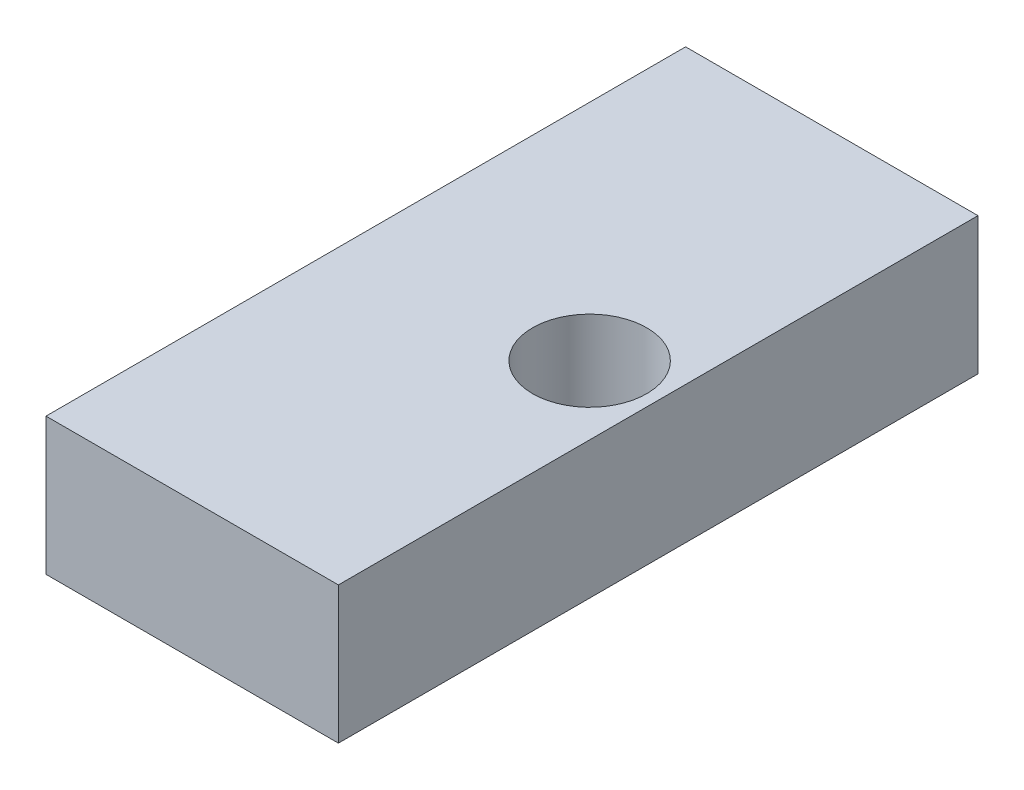
ISO-10303-21;
HEADER;
FILE_DESCRIPTION(('STEP AP214'),'2;1');
FILE_NAME('part.step','',(''),(''),'','','');
FILE_SCHEMA(('AUTOMOTIVE_DESIGN { 1 0 10303 214 1 1 1 1 }'));
ENDSEC;
DATA;
#1=APPLICATION_CONTEXT('core data for automotive mechanical design processes');
#2=APPLICATION_PROTOCOL_DEFINITION('international standard','automotive_design',2000,#1);
#3=PRODUCT_CONTEXT('',#1,'mechanical');
#4=PRODUCT('Part','Part','',(#3));
#5=PRODUCT_RELATED_PRODUCT_CATEGORY('part','',(#4));
#6=PRODUCT_DEFINITION_FORMATION('','',#4);
#7=PRODUCT_DEFINITION_CONTEXT('part definition',#1,'design');
#8=PRODUCT_DEFINITION('design','',#6,#7);
#9=PRODUCT_DEFINITION_SHAPE('','',#8);
#10=(LENGTH_UNIT() NAMED_UNIT(*) SI_UNIT(.MILLI.,.METRE.));
#11=(NAMED_UNIT(*) PLANE_ANGLE_UNIT() SI_UNIT($,.RADIAN.));
#12=(NAMED_UNIT(*) SI_UNIT($,.STERADIAN.) SOLID_ANGLE_UNIT());
#13=UNCERTAINTY_MEASURE_WITH_UNIT(LENGTH_MEASURE(1.E-05),#10,'distance_accuracy_value','');
#14=(GEOMETRIC_REPRESENTATION_CONTEXT(3) GLOBAL_UNCERTAINTY_ASSIGNED_CONTEXT((#13)) GLOBAL_UNIT_ASSIGNED_CONTEXT((#10,
#11,#12)) REPRESENTATION_CONTEXT('',''));
#15=CARTESIAN_POINT('',(0.,0.,0.));
#16=DIRECTION('',(0.,0.,1.));
#17=DIRECTION('',(1.,0.,0.));
#18=AXIS2_PLACEMENT_3D('',#15,#16,#17);
#19=CARTESIAN_POINT('',(20.32,9.525,-88.9));
#20=DIRECTION('',(1.,0.,0.));
#21=DIRECTION('',(0.,1.,0.));
#22=AXIS2_PLACEMENT_3D('',#19,#20,#21);
#23=PLANE('',#22);
#24=DIRECTION('',(0.,1.,0.));
#25=VECTOR('',#24,1.);
#26=CARTESIAN_POINT('',(20.32,9.525,0.));
#27=LINE('',#26,#25);
#28=CARTESIAN_POINT('',(20.32,-9.525,0.));
#29=VERTEX_POINT('',#28);
#30=CARTESIAN_POINT('',(20.32,9.525,0.));
#31=VERTEX_POINT('',#30);
#32=EDGE_CURVE('E98',#29,#31,#27,.T.);
#33=ORIENTED_EDGE('',*,*,#32,.F.);
#34=DIRECTION('',(0.,0.,1.));
#35=VECTOR('',#34,1.);
#36=CARTESIAN_POINT('',(20.32,-9.525,-88.9));
#37=LINE('',#36,#35);
#38=CARTESIAN_POINT('',(20.32,-9.525,-88.9));
#39=VERTEX_POINT('',#38);
#40=EDGE_CURVE('E11',#39,#29,#37,.T.);
#41=ORIENTED_EDGE('',*,*,#40,.F.);
#42=DIRECTION('',(0.,1.,0.));
#43=VECTOR('',#42,1.);
#44=CARTESIAN_POINT('',(20.32,9.525,-88.9));
#45=LINE('',#44,#43);
#46=CARTESIAN_POINT('',(20.32,9.525,-88.9));
#47=VERTEX_POINT('',#46);
#48=EDGE_CURVE('E91',#39,#47,#45,.T.);
#49=ORIENTED_EDGE('',*,*,#48,.T.);
#50=DIRECTION('',(0.,0.,1.));
#51=VECTOR('',#50,1.);
#52=CARTESIAN_POINT('',(20.32,9.525,-88.9));
#53=LINE('',#52,#51);
#54=EDGE_CURVE('E36',#47,#31,#53,.T.);
#55=ORIENTED_EDGE('',*,*,#54,.T.);
#56=EDGE_LOOP('',(#33,#41,#49,#55));
#57=FACE_BOUND('',#56,.T.);
#58=ADVANCED_FACE('F33',(#57),#23,.T.);
#59=CARTESIAN_POINT('',(-20.32,-9.525,-88.9));
#60=DIRECTION('',(0.,-1.,0.));
#61=DIRECTION('',(0.,0.,-1.));
#62=AXIS2_PLACEMENT_3D('',#59,#60,#61);
#63=PLANE('',#62);
#64=CARTESIAN_POINT('',(10.795,-9.525,-44.45));
#65=DIRECTION('',(0.,1.,0.));
#66=DIRECTION('',(0.,0.,1.));
#67=AXIS2_PLACEMENT_3D('',#64,#65,#66);
#68=CIRCLE('',#67,7.9375);
#69=CARTESIAN_POINT('',(10.795,-9.525,-36.5125));
#70=VERTEX_POINT('',#69);
#71=EDGE_CURVE('E102',#70,#70,#68,.T.);
#72=ORIENTED_EDGE('',*,*,#71,.T.);
#73=EDGE_LOOP('',(#72));
#74=FACE_BOUND('',#73,.T.);
#75=DIRECTION('',(1.,0.,0.));
#76=VECTOR('',#75,1.);
#77=CARTESIAN_POINT('',(-20.32,-9.525,0.));
#78=LINE('',#77,#76);
#79=CARTESIAN_POINT('',(-20.32,-9.525,0.));
#80=VERTEX_POINT('',#79);
#81=EDGE_CURVE('E93',#80,#29,#78,.T.);
#82=ORIENTED_EDGE('',*,*,#81,.F.);
#83=DIRECTION('',(0.,0.,1.));
#84=VECTOR('',#83,1.);
#85=CARTESIAN_POINT('',(-20.32,-9.525,-88.9));
#86=LINE('',#85,#84);
#87=CARTESIAN_POINT('',(-20.32,-9.525,-88.9));
#88=VERTEX_POINT('',#87);
#89=EDGE_CURVE('E42',#88,#80,#86,.T.);
#90=ORIENTED_EDGE('',*,*,#89,.F.);
#91=DIRECTION('',(1.,0.,0.));
#92=VECTOR('',#91,1.);
#93=CARTESIAN_POINT('',(-20.32,-9.525,-88.9));
#94=LINE('',#93,#92);
#95=EDGE_CURVE('E88',#88,#39,#94,.T.);
#96=ORIENTED_EDGE('',*,*,#95,.T.);
#97=ORIENTED_EDGE('',*,*,#40,.T.);
#98=EDGE_LOOP('',(#82,#90,#96,#97));
#99=FACE_BOUND('',#98,.T.);
#100=ADVANCED_FACE('F109',(#74,#99),#63,.T.);
#101=CARTESIAN_POINT('',(-20.32,9.525,-88.9));
#102=DIRECTION('',(-1.,0.,0.));
#103=DIRECTION('',(0.,-1.,0.));
#104=AXIS2_PLACEMENT_3D('',#101,#102,#103);
#105=PLANE('',#104);
#106=DIRECTION('',(0.,-1.,0.));
#107=VECTOR('',#106,1.);
#108=CARTESIAN_POINT('',(-20.32,9.525,0.));
#109=LINE('',#108,#107);
#110=CARTESIAN_POINT('',(-20.32,9.525,0.));
#111=VERTEX_POINT('',#110);
#112=EDGE_CURVE('E83',#111,#80,#109,.T.);
#113=ORIENTED_EDGE('',*,*,#112,.F.);
#114=DIRECTION('',(0.,0.,1.));
#115=VECTOR('',#114,1.);
#116=CARTESIAN_POINT('',(-20.32,9.525,-88.9));
#117=LINE('',#116,#115);
#118=CARTESIAN_POINT('',(-20.32,9.525,-88.9));
#119=VERTEX_POINT('',#118);
#120=EDGE_CURVE('E78',#119,#111,#117,.T.);
#121=ORIENTED_EDGE('',*,*,#120,.F.);
#122=DIRECTION('',(0.,-1.,0.));
#123=VECTOR('',#122,1.);
#124=CARTESIAN_POINT('',(-20.32,9.525,-88.9));
#125=LINE('',#124,#123);
#126=EDGE_CURVE('E81',#119,#88,#125,.T.);
#127=ORIENTED_EDGE('',*,*,#126,.T.);
#128=ORIENTED_EDGE('',*,*,#89,.T.);
#129=EDGE_LOOP('',(#113,#121,#127,#128));
#130=FACE_BOUND('',#129,.T.);
#131=ADVANCED_FACE('F80',(#130),#105,.T.);
#132=CARTESIAN_POINT('',(-20.32,9.525,-88.9));
#133=DIRECTION('',(0.,1.,0.));
#134=DIRECTION('',(0.,0.,1.));
#135=AXIS2_PLACEMENT_3D('',#132,#133,#134);
#136=PLANE('',#135);
#137=CARTESIAN_POINT('',(10.795,9.525,-44.45));
#138=DIRECTION('',(0.,1.,0.));
#139=DIRECTION('',(0.,0.,1.));
#140=AXIS2_PLACEMENT_3D('',#137,#138,#139);
#141=CIRCLE('',#140,7.9375);
#142=CARTESIAN_POINT('',(10.795,9.525,-36.5125));
#143=VERTEX_POINT('',#142);
#144=EDGE_CURVE('E128',#143,#143,#141,.T.);
#145=ORIENTED_EDGE('',*,*,#144,.F.);
#146=EDGE_LOOP('',(#145));
#147=FACE_BOUND('',#146,.T.);
#148=DIRECTION('',(-1.,0.,0.));
#149=VECTOR('',#148,1.);
#150=CARTESIAN_POINT('',(-20.32,9.525,0.));
#151=LINE('',#150,#149);
#152=EDGE_CURVE('E101',#31,#111,#151,.T.);
#153=ORIENTED_EDGE('',*,*,#152,.F.);
#154=ORIENTED_EDGE('',*,*,#54,.F.);
#155=DIRECTION('',(-1.,0.,0.));
#156=VECTOR('',#155,1.);
#157=CARTESIAN_POINT('',(-20.32,9.525,-88.9));
#158=LINE('',#157,#156);
#159=EDGE_CURVE('E87',#47,#119,#158,.T.);
#160=ORIENTED_EDGE('',*,*,#159,.T.);
#161=ORIENTED_EDGE('',*,*,#120,.T.);
#162=EDGE_LOOP('',(#153,#154,#160,#161));
#163=FACE_BOUND('',#162,.T.);
#164=ADVANCED_FACE('F90',(#147,#163),#136,.T.);
#165=CARTESIAN_POINT('',(0.,0.,-88.9));
#166=DIRECTION('',(0.,0.,1.));
#167=DIRECTION('',(1.,0.,0.));
#168=AXIS2_PLACEMENT_3D('',#165,#166,#167);
#169=PLANE('',#168);
#170=ORIENTED_EDGE('',*,*,#48,.F.);
#171=ORIENTED_EDGE('',*,*,#95,.F.);
#172=ORIENTED_EDGE('',*,*,#126,.F.);
#173=ORIENTED_EDGE('',*,*,#159,.F.);
#174=EDGE_LOOP('',(#170,#171,#172,#173));
#175=FACE_BOUND('',#174,.T.);
#176=ADVANCED_FACE('F86',(#175),#169,.F.);
#177=CARTESIAN_POINT('',(0.,0.,0.));
#178=DIRECTION('',(0.,0.,1.));
#179=DIRECTION('',(1.,0.,0.));
#180=AXIS2_PLACEMENT_3D('',#177,#178,#179);
#181=PLANE('',#180);
#182=ORIENTED_EDGE('',*,*,#32,.T.);
#183=ORIENTED_EDGE('',*,*,#152,.T.);
#184=ORIENTED_EDGE('',*,*,#112,.T.);
#185=ORIENTED_EDGE('',*,*,#81,.T.);
#186=EDGE_LOOP('',(#182,#183,#184,#185));
#187=FACE_BOUND('',#186,.T.);
#188=ADVANCED_FACE('F108',(#187),#181,.T.);
#189=CARTESIAN_POINT('',(10.795,-9.525,-44.45));
#190=DIRECTION('',(0.,1.,0.));
#191=DIRECTION('',(0.,0.,1.));
#192=AXIS2_PLACEMENT_3D('',#189,#190,#191);
#193=CYLINDRICAL_SURFACE('',#192,7.9375);
#194=ORIENTED_EDGE('',*,*,#71,.F.);
#195=EDGE_LOOP('',(#194));
#196=FACE_BOUND('',#195,.T.);
#197=ORIENTED_EDGE('',*,*,#144,.T.);
#198=EDGE_LOOP('',(#197));
#199=FACE_BOUND('',#198,.T.);
#200=ADVANCED_FACE('F133',(#196,#199),#193,.F.);
#201=CLOSED_SHELL('',(#58,#100,#131,#164,#176,#188,#200));
#202=MANIFOLD_SOLID_BREP('B2',#201);
#203=ADVANCED_BREP_SHAPE_REPRESENTATION('',(#18,#202),#14);
#204=SHAPE_DEFINITION_REPRESENTATION(#9,#203);
ENDSEC;
END-ISO-10303-21;
